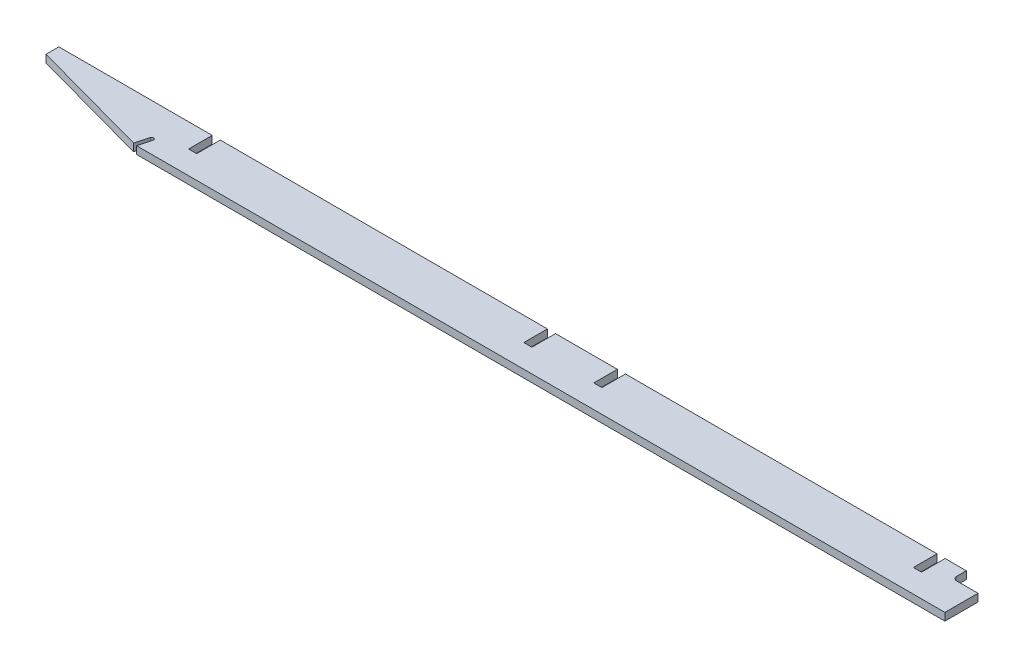
ISO-10303-21;
HEADER;
FILE_DESCRIPTION(('STEP AP214'),'2;1');
FILE_NAME('part.step','',(''),(''),'','','');
FILE_SCHEMA(('AUTOMOTIVE_DESIGN { 1 0 10303 214 1 1 1 1 }'));
ENDSEC;
DATA;
#1=APPLICATION_CONTEXT('core data for automotive mechanical design processes');
#2=APPLICATION_PROTOCOL_DEFINITION('international standard','automotive_design',2000,#1);
#3=PRODUCT_CONTEXT('',#1,'mechanical');
#4=PRODUCT('Part','Part','',(#3));
#5=PRODUCT_RELATED_PRODUCT_CATEGORY('part','',(#4));
#6=PRODUCT_DEFINITION_FORMATION('','',#4);
#7=PRODUCT_DEFINITION_CONTEXT('part definition',#1,'design');
#8=PRODUCT_DEFINITION('design','',#6,#7);
#9=PRODUCT_DEFINITION_SHAPE('','',#8);
#10=(LENGTH_UNIT() NAMED_UNIT(*) SI_UNIT(.MILLI.,.METRE.));
#11=(NAMED_UNIT(*) PLANE_ANGLE_UNIT() SI_UNIT($,.RADIAN.));
#12=(NAMED_UNIT(*) SI_UNIT($,.STERADIAN.) SOLID_ANGLE_UNIT());
#13=UNCERTAINTY_MEASURE_WITH_UNIT(LENGTH_MEASURE(1.E-05),#10,'distance_accuracy_value','');
#14=(GEOMETRIC_REPRESENTATION_CONTEXT(3) GLOBAL_UNCERTAINTY_ASSIGNED_CONTEXT((#13)) GLOBAL_UNIT_ASSIGNED_CONTEXT((#10,
#11,#12)) REPRESENTATION_CONTEXT('',''));
#15=CARTESIAN_POINT('',(0.,0.,0.));
#16=DIRECTION('',(0.,0.,1.));
#17=DIRECTION('',(1.,0.,0.));
#18=AXIS2_PLACEMENT_3D('',#15,#16,#17);
#19=CARTESIAN_POINT('',(-1457.76984888733,387.096,38.1));
#20=DIRECTION('',(-0.26471698178117,0.,0.964326147917118));
#21=DIRECTION('',(0.964326147917118,0.,0.26471698178117));
#22=AXIS2_PLACEMENT_3D('',#19,#20,#21);
#23=PLANE('',#22);
#24=DIRECTION('',(-0.964326147917118,0.,-0.26471698178117));
#25=VECTOR('',#24,1.);
#26=CARTESIAN_POINT('',(-1457.76984888733,374.65,38.1));
#27=LINE('',#26,#25);
#28=CARTESIAN_POINT('',(-1323.73398806948,374.65,74.8941578715673));
#29=VERTEX_POINT('',#28);
#30=CARTESIAN_POINT('',(-1520.36270603019,374.65,20.9176470588235));
#31=VERTEX_POINT('',#30);
#32=EDGE_CURVE('E370',#29,#31,#27,.T.);
#33=ORIENTED_EDGE('',*,*,#32,.F.);
#34=DIRECTION('',(0.,1.,0.));
#35=VECTOR('',#34,1.);
#36=CARTESIAN_POINT('',(-1323.73398806948,-2244.13415908109,74.8941578715673));
#37=LINE('',#36,#35);
#38=CARTESIAN_POINT('',(-1323.73398806948,387.096,74.8941578715673));
#39=VERTEX_POINT('',#38);
#40=EDGE_CURVE('E258',#29,#39,#37,.T.);
#41=ORIENTED_EDGE('',*,*,#40,.T.);
#42=DIRECTION('',(-0.964326147917118,0.,-0.26471698178117));
#43=VECTOR('',#42,1.);
#44=CARTESIAN_POINT('',(-1457.76984888733,387.096,38.1));
#45=LINE('',#44,#43);
#46=CARTESIAN_POINT('',(-1520.36270603019,387.096,20.9176470588235));
#47=VERTEX_POINT('',#46);
#48=EDGE_CURVE('E545',#39,#47,#45,.T.);
#49=ORIENTED_EDGE('',*,*,#48,.T.);
#50=DIRECTION('',(0.,-1.,0.));
#51=VECTOR('',#50,1.);
#52=CARTESIAN_POINT('',(-1520.36270603019,387.096,20.9176470588235));
#53=LINE('',#52,#51);
#54=EDGE_CURVE('E332',#47,#31,#53,.T.);
#55=ORIENTED_EDGE('',*,*,#54,.T.);
#56=EDGE_LOOP('',(#33,#41,#49,#55));
#57=FACE_BOUND('',#56,.T.);
#58=ADVANCED_FACE('F16',(#57),#23,.T.);
#59=CARTESIAN_POINT('',(-798.281353015096,387.096,44.45));
#60=DIRECTION('',(0.,-1.,0.));
#61=DIRECTION('',(1.,0.,0.));
#62=AXIS2_PLACEMENT_3D('',#59,#60,#61);
#63=PLANE('',#62);
#64=DIRECTION('',(0.26471698178117,0.,-0.964326147917118));
#65=VECTOR('',#64,1.);
#66=CARTESIAN_POINT('',(-1273.01779440205,387.096,-85.8698074395561));
#67=LINE('',#66,#65);
#68=CARTESIAN_POINT('',(-1317.50754546389,387.096,76.2));
#69=VERTEX_POINT('',#68);
#70=CARTESIAN_POINT('',(-1311.72718211012,387.096,55.1429620684198));
#71=VERTEX_POINT('',#70);
#72=EDGE_CURVE('E324',#69,#71,#67,.T.);
#73=ORIENTED_EDGE('',*,*,#72,.F.);
#74=DIRECTION('',(1.,0.,0.));
#75=VECTOR('',#74,1.);
#76=CARTESIAN_POINT('',(-660.4,387.096,76.2));
#77=LINE('',#76,#75);
#78=CARTESIAN_POINT('',(2.22044604925032E-13,387.096,76.2));
#79=VERTEX_POINT('',#78);
#80=EDGE_CURVE('E541',#69,#79,#77,.T.);
#81=ORIENTED_EDGE('',*,*,#80,.T.);
#82=DIRECTION('',(0.,0.,1.));
#83=VECTOR('',#82,1.);
#84=CARTESIAN_POINT('',(2.22044604925032E-13,387.096,44.45));
#85=LINE('',#84,#83);
#86=CARTESIAN_POINT('',(2.22044604925032E-13,387.096,22.225));
#87=VERTEX_POINT('',#86);
#88=EDGE_CURVE('E504',#87,#79,#85,.T.);
#89=ORIENTED_EDGE('',*,*,#88,.F.);
#90=DIRECTION('',(-1.,0.,0.));
#91=VECTOR('',#90,1.);
#92=CARTESIAN_POINT('',(-798.281353015096,387.096,22.225));
#93=LINE('',#92,#91);
#94=CARTESIAN_POINT('',(-34.925,387.096,22.225));
#95=VERTEX_POINT('',#94);
#96=EDGE_CURVE('E317',#87,#95,#93,.T.);
#97=ORIENTED_EDGE('',*,*,#96,.T.);
#98=CARTESIAN_POINT('',(-34.925,387.096,15.875));
#99=DIRECTION('',(0.,-1.,0.));
#100=DIRECTION('',(0.,0.,-1.));
#101=AXIS2_PLACEMENT_3D('',#98,#99,#100);
#102=CIRCLE('',#101,6.35);
#103=CARTESIAN_POINT('',(-41.275,387.096,15.875));
#104=VERTEX_POINT('',#103);
#105=EDGE_CURVE('E25',#95,#104,#102,.T.);
#106=ORIENTED_EDGE('',*,*,#105,.T.);
#107=DIRECTION('',(0.,0.,-1.));
#108=VECTOR('',#107,1.);
#109=CARTESIAN_POINT('',(-41.275,387.096,44.45));
#110=LINE('',#109,#108);
#111=CARTESIAN_POINT('',(-41.275,387.096,0.));
#112=VERTEX_POINT('',#111);
#113=EDGE_CURVE('E314',#104,#112,#110,.T.);
#114=ORIENTED_EDGE('',*,*,#113,.T.);
#115=DIRECTION('',(1.,0.,0.));
#116=VECTOR('',#115,1.);
#117=CARTESIAN_POINT('',(-931.631353015096,387.096,0.));
#118=LINE('',#117,#116);
#119=CARTESIAN_POINT('',(-75.803125,387.096,0.));
#120=VERTEX_POINT('',#119);
#121=EDGE_CURVE('E365',#120,#112,#118,.T.);
#122=ORIENTED_EDGE('',*,*,#121,.F.);
#123=DIRECTION('',(0.,0.,-1.));
#124=VECTOR('',#123,1.);
#125=CARTESIAN_POINT('',(-75.803125,387.096,38.1));
#126=LINE('',#125,#124);
#127=CARTESIAN_POINT('',(-75.803125,387.096,38.496875));
#128=VERTEX_POINT('',#127);
#129=EDGE_CURVE('E316',#128,#120,#126,.T.);
#130=ORIENTED_EDGE('',*,*,#129,.F.);
#131=DIRECTION('',(-1.,0.,0.));
#132=VECTOR('',#131,1.);
#133=CARTESIAN_POINT('',(-59.5983301642671,387.096,38.496875));
#134=LINE('',#133,#132);
#135=CARTESIAN_POINT('',(-89.0428750000001,387.096,38.496875));
#136=VERTEX_POINT('',#135);
#137=EDGE_CURVE('E339',#128,#136,#134,.T.);
#138=ORIENTED_EDGE('',*,*,#137,.T.);
#139=DIRECTION('',(0.,0.,1.));
#140=VECTOR('',#139,1.);
#141=CARTESIAN_POINT('',(-89.0428750000001,387.096,38.1));
#142=LINE('',#141,#140);
#143=CARTESIAN_POINT('',(-89.0428750000001,387.096,0.));
#144=VERTEX_POINT('',#143);
#145=EDGE_CURVE('E353',#144,#136,#142,.T.);
#146=ORIENTED_EDGE('',*,*,#145,.F.);
#147=CARTESIAN_POINT('',(-596.773,387.096,0.));
#148=VERTEX_POINT('',#147);
#149=EDGE_CURVE('E369',#148,#144,#118,.T.);
#150=ORIENTED_EDGE('',*,*,#149,.F.);
#151=DIRECTION('',(0.,0.,1.));
#152=VECTOR('',#151,1.);
#153=CARTESIAN_POINT('',(-596.773,387.096,44.45));
#154=LINE('',#153,#152);
#155=CARTESIAN_POINT('',(-596.773,387.096,38.481));
#156=VERTEX_POINT('',#155);
#157=EDGE_CURVE('E1074',#148,#156,#154,.T.);
#158=ORIENTED_EDGE('',*,*,#157,.T.);
#159=DIRECTION('',(-1.,0.,0.));
#160=VECTOR('',#159,1.);
#161=CARTESIAN_POINT('',(-798.281353015096,387.096,38.481));
#162=LINE('',#161,#160);
#163=CARTESIAN_POINT('',(-609.981,387.096,38.481));
#164=VERTEX_POINT('',#163);
#165=EDGE_CURVE('E392',#156,#164,#162,.T.);
#166=ORIENTED_EDGE('',*,*,#165,.T.);
#167=DIRECTION('',(0.,0.,-1.));
#168=VECTOR('',#167,1.);
#169=CARTESIAN_POINT('',(-609.981,387.096,44.45));
#170=LINE('',#169,#168);
#171=CARTESIAN_POINT('',(-609.981,387.096,0.));
#172=VERTEX_POINT('',#171);
#173=EDGE_CURVE('E1049',#164,#172,#170,.T.);
#174=ORIENTED_EDGE('',*,*,#173,.T.);
#175=CARTESIAN_POINT('',(-710.819,387.096,0.));
#176=VERTEX_POINT('',#175);
#177=EDGE_CURVE('E428',#176,#172,#118,.T.);
#178=ORIENTED_EDGE('',*,*,#177,.F.);
#179=DIRECTION('',(0.,0.,1.));
#180=VECTOR('',#179,1.);
#181=CARTESIAN_POINT('',(-710.819,387.096,44.45));
#182=LINE('',#181,#180);
#183=CARTESIAN_POINT('',(-710.819,387.096,38.481));
#184=VERTEX_POINT('',#183);
#185=EDGE_CURVE('E1168',#176,#184,#182,.T.);
#186=ORIENTED_EDGE('',*,*,#185,.T.);
#187=DIRECTION('',(-1.,0.,0.));
#188=VECTOR('',#187,1.);
#189=CARTESIAN_POINT('',(-798.281353015096,387.096,38.481));
#190=LINE('',#189,#188);
#191=CARTESIAN_POINT('',(-724.027,387.096,38.481));
#192=VERTEX_POINT('',#191);
#193=EDGE_CURVE('E1161',#184,#192,#190,.T.);
#194=ORIENTED_EDGE('',*,*,#193,.T.);
#195=DIRECTION('',(0.,0.,-1.));
#196=VECTOR('',#195,1.);
#197=CARTESIAN_POINT('',(-724.027,387.096,44.45));
#198=LINE('',#197,#196);
#199=CARTESIAN_POINT('',(-724.027,387.096,0.));
#200=VERTEX_POINT('',#199);
#201=EDGE_CURVE('E1050',#192,#200,#198,.T.);
#202=ORIENTED_EDGE('',*,*,#201,.T.);
#203=CARTESIAN_POINT('',(-1257.173,387.096,0.));
#204=VERTEX_POINT('',#203);
#205=EDGE_CURVE('E424',#204,#200,#118,.T.);
#206=ORIENTED_EDGE('',*,*,#205,.F.);
#207=DIRECTION('',(0.,0.,1.));
#208=VECTOR('',#207,1.);
#209=CARTESIAN_POINT('',(-1257.173,387.096,44.45));
#210=LINE('',#209,#208);
#211=CARTESIAN_POINT('',(-1257.173,387.096,38.481));
#212=VERTEX_POINT('',#211);
#213=EDGE_CURVE('E456',#204,#212,#210,.T.);
#214=ORIENTED_EDGE('',*,*,#213,.T.);
#215=DIRECTION('',(-1.,0.,0.));
#216=VECTOR('',#215,1.);
#217=CARTESIAN_POINT('',(-798.281353015096,387.096,38.481));
#218=LINE('',#217,#216);
#219=CARTESIAN_POINT('',(-1270.381,387.096,38.481));
#220=VERTEX_POINT('',#219);
#221=EDGE_CURVE('E451',#212,#220,#218,.T.);
#222=ORIENTED_EDGE('',*,*,#221,.T.);
#223=DIRECTION('',(0.,0.,-1.));
#224=VECTOR('',#223,1.);
#225=CARTESIAN_POINT('',(-1270.381,387.096,44.45));
#226=LINE('',#225,#224);
#227=CARTESIAN_POINT('',(-1270.381,387.096,0.));
#228=VERTEX_POINT('',#227);
#229=EDGE_CURVE('E480',#220,#228,#226,.T.);
#230=ORIENTED_EDGE('',*,*,#229,.T.);
#231=CARTESIAN_POINT('',(-1520.36270603019,387.096,0.));
#232=VERTEX_POINT('',#231);
#233=EDGE_CURVE('E372',#232,#228,#118,.T.);
#234=ORIENTED_EDGE('',*,*,#233,.F.);
#235=DIRECTION('',(0.,0.,-1.));
#236=VECTOR('',#235,1.);
#237=CARTESIAN_POINT('',(-1520.36270603019,387.096,20.9176470588235));
#238=LINE('',#237,#236);
#239=EDGE_CURVE('E264',#232,#47,#238,.F.);
#240=ORIENTED_EDGE('',*,*,#239,.T.);
#241=ORIENTED_EDGE('',*,*,#48,.F.);
#242=DIRECTION('',(0.26471698178117,0.,-0.964326147917118));
#243=VECTOR('',#242,1.);
#244=CARTESIAN_POINT('',(-1279.14126544132,387.096,-87.5507602738665));
#245=LINE('',#244,#243);
#246=CARTESIAN_POINT('',(-1317.8506531494,387.096,53.4620092341093));
#247=VERTEX_POINT('',#246);
#248=EDGE_CURVE('E599',#39,#247,#245,.T.);
#249=ORIENTED_EDGE('',*,*,#248,.T.);
#250=CARTESIAN_POINT('',(-1314.78891762976,387.096,54.3024856512645));
#251=DIRECTION('',(0.,-1.,0.));
#252=DIRECTION('',(0.,0.,-1.));
#253=AXIS2_PLACEMENT_3D('',#250,#251,#252);
#254=CIRCLE('',#253,3.175);
#255=EDGE_CURVE('E271',#247,#71,#254,.T.);
#256=ORIENTED_EDGE('',*,*,#255,.T.);
#257=EDGE_LOOP('',(#73,#81,#89,#97,#106,#114,#122,#130,#138,#146,#150,#158,#166,#174,#178,#186,
#194,#202,#206,#214,#222,#230,#234,#240,#241,#249,#256));
#258=FACE_BOUND('',#257,.T.);
#259=ADVANCED_FACE('F561',(#258),#63,.F.);
#260=CARTESIAN_POINT('',(-660.4,387.096,76.2));
#261=DIRECTION('',(0.,0.,-1.));
#262=DIRECTION('',(-1.,0.,0.));
#263=AXIS2_PLACEMENT_3D('',#260,#261,#262);
#264=PLANE('',#263);
#265=DIRECTION('',(0.,1.,0.));
#266=VECTOR('',#265,1.);
#267=CARTESIAN_POINT('',(-1317.50754546389,387.096,76.2));
#268=LINE('',#267,#266);
#269=CARTESIAN_POINT('',(-1317.50754546389,374.65,76.2));
#270=VERTEX_POINT('',#269);
#271=EDGE_CURVE('E584',#270,#69,#268,.T.);
#272=ORIENTED_EDGE('',*,*,#271,.F.);
#273=DIRECTION('',(1.,0.,0.));
#274=VECTOR('',#273,1.);
#275=CARTESIAN_POINT('',(-660.4,374.65,76.2));
#276=LINE('',#275,#274);
#277=CARTESIAN_POINT('',(2.22044604925032E-13,374.65,76.2));
#278=VERTEX_POINT('',#277);
#279=EDGE_CURVE('E412',#270,#278,#276,.T.);
#280=ORIENTED_EDGE('',*,*,#279,.T.);
#281=DIRECTION('',(0.,-1.,0.));
#282=VECTOR('',#281,1.);
#283=CARTESIAN_POINT('',(2.22044604925032E-13,387.096,76.2));
#284=LINE('',#283,#282);
#285=EDGE_CURVE('E441',#79,#278,#284,.T.);
#286=ORIENTED_EDGE('',*,*,#285,.F.);
#287=ORIENTED_EDGE('',*,*,#80,.F.);
#288=EDGE_LOOP('',(#272,#280,#286,#287));
#289=FACE_BOUND('',#288,.T.);
#290=ADVANCED_FACE('F556',(#289),#264,.F.);
#291=CARTESIAN_POINT('',(-798.281353015096,374.65,44.45));
#292=DIRECTION('',(0.,-1.,0.));
#293=DIRECTION('',(1.,0.,0.));
#294=AXIS2_PLACEMENT_3D('',#291,#292,#293);
#295=PLANE('',#294);
#296=ORIENTED_EDGE('',*,*,#279,.F.);
#297=DIRECTION('',(0.26471698178117,0.,-0.964326147917118));
#298=VECTOR('',#297,1.);
#299=CARTESIAN_POINT('',(-1273.01779440205,374.65,-85.8698074395561));
#300=LINE('',#299,#298);
#301=CARTESIAN_POINT('',(-1311.72718211012,374.65,55.1429620684198));
#302=VERTEX_POINT('',#301);
#303=EDGE_CURVE('E278',#270,#302,#300,.T.);
#304=ORIENTED_EDGE('',*,*,#303,.T.);
#305=CARTESIAN_POINT('',(-1314.78891762976,374.65,54.3024856512645));
#306=DIRECTION('',(0.,-1.,0.));
#307=DIRECTION('',(0.,0.,-1.));
#308=AXIS2_PLACEMENT_3D('',#305,#306,#307);
#309=CIRCLE('',#308,3.175);
#310=CARTESIAN_POINT('',(-1317.8506531494,374.65,53.4620092341093));
#311=VERTEX_POINT('',#310);
#312=EDGE_CURVE('E263',#311,#302,#309,.T.);
#313=ORIENTED_EDGE('',*,*,#312,.F.);
#314=DIRECTION('',(0.26471698178117,0.,-0.964326147917118));
#315=VECTOR('',#314,1.);
#316=CARTESIAN_POINT('',(-1279.14126544132,374.65,-87.5507602738665));
#317=LINE('',#316,#315);
#318=EDGE_CURVE('E252',#29,#311,#317,.T.);
#319=ORIENTED_EDGE('',*,*,#318,.F.);
#320=ORIENTED_EDGE('',*,*,#32,.T.);
#321=DIRECTION('',(0.,0.,1.));
#322=VECTOR('',#321,1.);
#323=CARTESIAN_POINT('',(-1520.36270603019,374.65,44.4500000000076));
#324=LINE('',#323,#322);
#325=CARTESIAN_POINT('',(-1520.36270603019,374.65,0.));
#326=VERTEX_POINT('',#325);
#327=EDGE_CURVE('E1132',#31,#326,#324,.F.);
#328=ORIENTED_EDGE('',*,*,#327,.T.);
#329=DIRECTION('',(1.,0.,0.));
#330=VECTOR('',#329,1.);
#331=CARTESIAN_POINT('',(-931.631353015096,374.65,0.));
#332=LINE('',#331,#330);
#333=CARTESIAN_POINT('',(-1270.381,374.65,-1.45716771982052E-13));
#334=VERTEX_POINT('',#333);
#335=EDGE_CURVE('E394',#326,#334,#332,.T.);
#336=ORIENTED_EDGE('',*,*,#335,.T.);
#337=DIRECTION('',(0.,0.,-1.));
#338=VECTOR('',#337,1.);
#339=CARTESIAN_POINT('',(-1270.381,374.65,44.45));
#340=LINE('',#339,#338);
#341=CARTESIAN_POINT('',(-1270.381,374.65,38.481));
#342=VERTEX_POINT('',#341);
#343=EDGE_CURVE('E434',#342,#334,#340,.T.);
#344=ORIENTED_EDGE('',*,*,#343,.F.);
#345=DIRECTION('',(-1.,0.,0.));
#346=VECTOR('',#345,1.);
#347=CARTESIAN_POINT('',(-798.281353015096,374.65,38.481));
#348=LINE('',#347,#346);
#349=CARTESIAN_POINT('',(-1257.173,374.65,38.481));
#350=VERTEX_POINT('',#349);
#351=EDGE_CURVE('E431',#350,#342,#348,.T.);
#352=ORIENTED_EDGE('',*,*,#351,.F.);
#353=DIRECTION('',(0.,0.,1.));
#354=VECTOR('',#353,1.);
#355=CARTESIAN_POINT('',(-1257.173,374.65,44.45));
#356=LINE('',#355,#354);
#357=CARTESIAN_POINT('',(-1257.173,374.65,0.));
#358=VERTEX_POINT('',#357);
#359=EDGE_CURVE('E435',#358,#350,#356,.T.);
#360=ORIENTED_EDGE('',*,*,#359,.F.);
#361=CARTESIAN_POINT('',(-724.027,374.65,-1.45716771982052E-13));
#362=VERTEX_POINT('',#361);
#363=EDGE_CURVE('E416',#358,#362,#332,.T.);
#364=ORIENTED_EDGE('',*,*,#363,.T.);
#365=DIRECTION('',(0.,0.,-1.));
#366=VECTOR('',#365,1.);
#367=CARTESIAN_POINT('',(-724.027,374.65,44.45));
#368=LINE('',#367,#366);
#369=CARTESIAN_POINT('',(-724.027,374.65,38.481));
#370=VERTEX_POINT('',#369);
#371=EDGE_CURVE('E1067',#370,#362,#368,.T.);
#372=ORIENTED_EDGE('',*,*,#371,.F.);
#373=DIRECTION('',(-1.,0.,0.));
#374=VECTOR('',#373,1.);
#375=CARTESIAN_POINT('',(-798.281353015096,374.65,38.481));
#376=LINE('',#375,#374);
#377=CARTESIAN_POINT('',(-710.819,374.65,38.481));
#378=VERTEX_POINT('',#377);
#379=EDGE_CURVE('E1122',#378,#370,#376,.T.);
#380=ORIENTED_EDGE('',*,*,#379,.F.);
#381=DIRECTION('',(0.,0.,1.));
#382=VECTOR('',#381,1.);
#383=CARTESIAN_POINT('',(-710.819,374.65,44.45));
#384=LINE('',#383,#382);
#385=CARTESIAN_POINT('',(-710.819,374.65,0.));
#386=VERTEX_POINT('',#385);
#387=EDGE_CURVE('E447',#386,#378,#384,.T.);
#388=ORIENTED_EDGE('',*,*,#387,.F.);
#389=CARTESIAN_POINT('',(-609.981,374.65,-1.45716771982052E-13));
#390=VERTEX_POINT('',#389);
#391=EDGE_CURVE('E420',#386,#390,#332,.T.);
#392=ORIENTED_EDGE('',*,*,#391,.T.);
#393=DIRECTION('',(0.,0.,-1.));
#394=VECTOR('',#393,1.);
#395=CARTESIAN_POINT('',(-609.981,374.65,44.45));
#396=LINE('',#395,#394);
#397=CARTESIAN_POINT('',(-609.981,374.65,38.481));
#398=VERTEX_POINT('',#397);
#399=EDGE_CURVE('E1063',#398,#390,#396,.T.);
#400=ORIENTED_EDGE('',*,*,#399,.F.);
#401=DIRECTION('',(-1.,0.,0.));
#402=VECTOR('',#401,1.);
#403=CARTESIAN_POINT('',(-798.281353015096,374.65,38.481));
#404=LINE('',#403,#402);
#405=CARTESIAN_POINT('',(-596.773,374.65,38.481));
#406=VERTEX_POINT('',#405);
#407=EDGE_CURVE('E1066',#406,#398,#404,.T.);
#408=ORIENTED_EDGE('',*,*,#407,.F.);
#409=DIRECTION('',(0.,0.,1.));
#410=VECTOR('',#409,1.);
#411=CARTESIAN_POINT('',(-596.773,374.65,44.45));
#412=LINE('',#411,#410);
#413=CARTESIAN_POINT('',(-596.773,374.65,-1.45716771982052E-13));
#414=VERTEX_POINT('',#413);
#415=EDGE_CURVE('E383',#414,#406,#412,.T.);
#416=ORIENTED_EDGE('',*,*,#415,.F.);
#417=CARTESIAN_POINT('',(-89.0428750000001,374.65,-1.45716771982052E-13));
#418=VERTEX_POINT('',#417);
#419=EDGE_CURVE('E391',#414,#418,#332,.T.);
#420=ORIENTED_EDGE('',*,*,#419,.T.);
#421=DIRECTION('',(0.,0.,-1.));
#422=VECTOR('',#421,1.);
#423=CARTESIAN_POINT('',(-89.0428750000001,374.65,44.45));
#424=LINE('',#423,#422);
#425=CARTESIAN_POINT('',(-89.0428750000001,374.65,38.496875));
#426=VERTEX_POINT('',#425);
#427=EDGE_CURVE('E309',#426,#418,#424,.T.);
#428=ORIENTED_EDGE('',*,*,#427,.F.);
#429=DIRECTION('',(1.,0.,0.));
#430=VECTOR('',#429,1.);
#431=CARTESIAN_POINT('',(-798.281353015096,374.65,38.4968750000003));
#432=LINE('',#431,#430);
#433=CARTESIAN_POINT('',(-75.803125,374.65,38.496875));
#434=VERTEX_POINT('',#433);
#435=EDGE_CURVE('E382',#426,#434,#432,.T.);
#436=ORIENTED_EDGE('',*,*,#435,.T.);
#437=DIRECTION('',(0.,0.,1.));
#438=VECTOR('',#437,1.);
#439=CARTESIAN_POINT('',(-75.803125,374.65,44.45));
#440=LINE('',#439,#438);
#441=CARTESIAN_POINT('',(-75.803125,374.65,0.));
#442=VERTEX_POINT('',#441);
#443=EDGE_CURVE('E379',#442,#434,#440,.T.);
#444=ORIENTED_EDGE('',*,*,#443,.F.);
#445=CARTESIAN_POINT('',(-41.275,374.65,0.));
#446=VERTEX_POINT('',#445);
#447=EDGE_CURVE('E388',#442,#446,#332,.T.);
#448=ORIENTED_EDGE('',*,*,#447,.T.);
#449=DIRECTION('',(0.,0.,-1.));
#450=VECTOR('',#449,1.);
#451=CARTESIAN_POINT('',(-41.275,374.65,44.45));
#452=LINE('',#451,#450);
#453=CARTESIAN_POINT('',(-41.275,374.65,15.875));
#454=VERTEX_POINT('',#453);
#455=EDGE_CURVE('E308',#454,#446,#452,.T.);
#456=ORIENTED_EDGE('',*,*,#455,.F.);
#457=CARTESIAN_POINT('',(-34.925,374.65,15.875));
#458=DIRECTION('',(0.,-1.,0.));
#459=DIRECTION('',(0.,0.,-1.));
#460=AXIS2_PLACEMENT_3D('',#457,#458,#459);
#461=CIRCLE('',#460,6.35);
#462=CARTESIAN_POINT('',(-34.925,374.65,22.225));
#463=VERTEX_POINT('',#462);
#464=EDGE_CURVE('E11',#454,#463,#461,.F.);
#465=ORIENTED_EDGE('',*,*,#464,.T.);
#466=DIRECTION('',(-1.,0.,0.));
#467=VECTOR('',#466,1.);
#468=CARTESIAN_POINT('',(-798.281353015096,374.65,22.225));
#469=LINE('',#468,#467);
#470=CARTESIAN_POINT('',(2.22044604925032E-13,374.65,22.225));
#471=VERTEX_POINT('',#470);
#472=EDGE_CURVE('E304',#471,#463,#469,.T.);
#473=ORIENTED_EDGE('',*,*,#472,.F.);
#474=DIRECTION('',(0.,0.,1.));
#475=VECTOR('',#474,1.);
#476=CARTESIAN_POINT('',(2.22044604925032E-13,374.65,44.45));
#477=LINE('',#476,#475);
#478=EDGE_CURVE('E408',#471,#278,#477,.T.);
#479=ORIENTED_EDGE('',*,*,#478,.T.);
#480=EDGE_LOOP('',(#296,#304,#313,#319,#320,#328,#336,#344,#352,#360,#364,#372,#380,#388,#392,
#400,#408,#416,#420,#428,#436,#444,#448,#456,#465,#473,#479));
#481=FACE_BOUND('',#480,.T.);
#482=ADVANCED_FACE('F277',(#481),#295,.T.);
#483=CARTESIAN_POINT('',(-931.631353015096,387.096,0.));
#484=DIRECTION('',(0.,0.,-1.));
#485=DIRECTION('',(-1.,0.,0.));
#486=AXIS2_PLACEMENT_3D('',#483,#484,#485);
#487=PLANE('',#486);
#488=DIRECTION('',(0.,1.,0.));
#489=VECTOR('',#488,1.);
#490=CARTESIAN_POINT('',(-89.0428750000001,387.096,0.));
#491=LINE('',#490,#489);
#492=EDGE_CURVE('E360',#418,#144,#491,.T.);
#493=ORIENTED_EDGE('',*,*,#492,.F.);
#494=ORIENTED_EDGE('',*,*,#419,.F.);
#495=DIRECTION('',(0.,-1.,0.));
#496=VECTOR('',#495,1.);
#497=CARTESIAN_POINT('',(-596.773,387.096,0.));
#498=LINE('',#497,#496);
#499=EDGE_CURVE('E1072',#148,#414,#498,.T.);
#500=ORIENTED_EDGE('',*,*,#499,.F.);
#501=ORIENTED_EDGE('',*,*,#149,.T.);
#502=EDGE_LOOP('',(#493,#494,#500,#501));
#503=FACE_BOUND('',#502,.T.);
#504=ADVANCED_FACE('F685',(#503),#487,.T.);
#505=DIRECTION('',(0.,1.,0.));
#506=VECTOR('',#505,1.);
#507=CARTESIAN_POINT('',(-41.275,-2295.26058781173,0.));
#508=LINE('',#507,#506);
#509=EDGE_CURVE('E320',#446,#112,#508,.T.);
#510=ORIENTED_EDGE('',*,*,#509,.F.);
#511=ORIENTED_EDGE('',*,*,#447,.F.);
#512=DIRECTION('',(0.,-1.,0.));
#513=VECTOR('',#512,1.);
#514=CARTESIAN_POINT('',(-75.8031250000001,387.096,0.));
#515=LINE('',#514,#513);
#516=EDGE_CURVE('E346',#120,#442,#515,.T.);
#517=ORIENTED_EDGE('',*,*,#516,.F.);
#518=ORIENTED_EDGE('',*,*,#121,.T.);
#519=EDGE_LOOP('',(#510,#511,#517,#518));
#520=FACE_BOUND('',#519,.T.);
#521=ADVANCED_FACE('F721',(#520),#487,.T.);
#522=DIRECTION('',(0.,1.,0.));
#523=VECTOR('',#522,1.);
#524=CARTESIAN_POINT('',(-724.027,387.096,0.));
#525=LINE('',#524,#523);
#526=EDGE_CURVE('E1158',#362,#200,#525,.T.);
#527=ORIENTED_EDGE('',*,*,#526,.F.);
#528=ORIENTED_EDGE('',*,*,#363,.F.);
#529=DIRECTION('',(0.,-1.,0.));
#530=VECTOR('',#529,1.);
#531=CARTESIAN_POINT('',(-1257.173,387.096,0.));
#532=LINE('',#531,#530);
#533=EDGE_CURVE('E463',#204,#358,#532,.T.);
#534=ORIENTED_EDGE('',*,*,#533,.F.);
#535=ORIENTED_EDGE('',*,*,#205,.T.);
#536=EDGE_LOOP('',(#527,#528,#534,#535));
#537=FACE_BOUND('',#536,.T.);
#538=ADVANCED_FACE('F528',(#537),#487,.T.);
#539=ORIENTED_EDGE('',*,*,#335,.F.);
#540=DIRECTION('',(0.,1.,0.));
#541=VECTOR('',#540,1.);
#542=CARTESIAN_POINT('',(-1520.36270603019,387.096,0.));
#543=LINE('',#542,#541);
#544=EDGE_CURVE('E1135',#326,#232,#543,.T.);
#545=ORIENTED_EDGE('',*,*,#544,.T.);
#546=ORIENTED_EDGE('',*,*,#233,.T.);
#547=DIRECTION('',(0.,1.,0.));
#548=VECTOR('',#547,1.);
#549=CARTESIAN_POINT('',(-1270.381,387.096,0.));
#550=LINE('',#549,#548);
#551=EDGE_CURVE('E455',#334,#228,#550,.T.);
#552=ORIENTED_EDGE('',*,*,#551,.F.);
#553=EDGE_LOOP('',(#539,#545,#546,#552));
#554=FACE_BOUND('',#553,.T.);
#555=ADVANCED_FACE('F522',(#554),#487,.T.);
#556=DIRECTION('',(0.,1.,0.));
#557=VECTOR('',#556,1.);
#558=CARTESIAN_POINT('',(-609.981,387.096,0.));
#559=LINE('',#558,#557);
#560=EDGE_CURVE('E1046',#390,#172,#559,.T.);
#561=ORIENTED_EDGE('',*,*,#560,.F.);
#562=ORIENTED_EDGE('',*,*,#391,.F.);
#563=DIRECTION('',(0.,-1.,0.));
#564=VECTOR('',#563,1.);
#565=CARTESIAN_POINT('',(-710.819,387.096,0.));
#566=LINE('',#565,#564);
#567=EDGE_CURVE('E483',#176,#386,#566,.T.);
#568=ORIENTED_EDGE('',*,*,#567,.F.);
#569=ORIENTED_EDGE('',*,*,#177,.T.);
#570=EDGE_LOOP('',(#561,#562,#568,#569));
#571=FACE_BOUND('',#570,.T.);
#572=ADVANCED_FACE('F527',(#571),#487,.T.);
#573=CARTESIAN_POINT('',(2.22044604925032E-13,387.096,38.1));
#574=DIRECTION('',(1.,0.,0.));
#575=DIRECTION('',(0.,0.,-1.));
#576=AXIS2_PLACEMENT_3D('',#573,#574,#575);
#577=PLANE('',#576);
#578=DIRECTION('',(0.,-1.,0.));
#579=VECTOR('',#578,1.);
#580=CARTESIAN_POINT('',(2.22044604925032E-13,387.096,22.225));
#581=LINE('',#580,#579);
#582=EDGE_CURVE('E323',#87,#471,#581,.T.);
#583=ORIENTED_EDGE('',*,*,#582,.F.);
#584=ORIENTED_EDGE('',*,*,#88,.T.);
#585=ORIENTED_EDGE('',*,*,#285,.T.);
#586=ORIENTED_EDGE('',*,*,#478,.F.);
#587=EDGE_LOOP('',(#583,#584,#585,#586));
#588=FACE_BOUND('',#587,.T.);
#589=ADVANCED_FACE('F753',(#588),#577,.T.);
#590=CARTESIAN_POINT('',(-1270.381,-2244.46058781173,38.1));
#591=DIRECTION('',(-1.,0.,0.));
#592=DIRECTION('',(0.,0.,1.));
#593=AXIS2_PLACEMENT_3D('',#590,#591,#592);
#594=PLANE('',#593);
#595=DIRECTION('',(0.,1.,0.));
#596=VECTOR('',#595,1.);
#597=CARTESIAN_POINT('',(-1270.381,-2244.46058781173,38.481));
#598=LINE('',#597,#596);
#599=EDGE_CURVE('E470',#342,#220,#598,.T.);
#600=ORIENTED_EDGE('',*,*,#599,.F.);
#601=ORIENTED_EDGE('',*,*,#343,.T.);
#602=ORIENTED_EDGE('',*,*,#551,.T.);
#603=ORIENTED_EDGE('',*,*,#229,.F.);
#604=EDGE_LOOP('',(#600,#601,#602,#603));
#605=FACE_BOUND('',#604,.T.);
#606=ADVANCED_FACE('F763',(#605),#594,.F.);
#607=CARTESIAN_POINT('',(-936.879,-2244.46058781173,38.481));
#608=DIRECTION('',(0.,0.,1.));
#609=DIRECTION('',(1.,0.,0.));
#610=AXIS2_PLACEMENT_3D('',#607,#608,#609);
#611=PLANE('',#610);
#612=DIRECTION('',(0.,1.,0.));
#613=VECTOR('',#612,1.);
#614=CARTESIAN_POINT('',(-1257.173,-2244.46058781173,38.481));
#615=LINE('',#614,#613);
#616=EDGE_CURVE('E398',#350,#212,#615,.T.);
#617=ORIENTED_EDGE('',*,*,#616,.F.);
#618=ORIENTED_EDGE('',*,*,#351,.T.);
#619=ORIENTED_EDGE('',*,*,#599,.T.);
#620=ORIENTED_EDGE('',*,*,#221,.F.);
#621=EDGE_LOOP('',(#617,#618,#619,#620));
#622=FACE_BOUND('',#621,.T.);
#623=ADVANCED_FACE('F774',(#622),#611,.F.);
#624=CARTESIAN_POINT('',(-1257.173,-2244.46058781173,38.1));
#625=DIRECTION('',(1.,0.,0.));
#626=DIRECTION('',(0.,0.,-1.));
#627=AXIS2_PLACEMENT_3D('',#624,#625,#626);
#628=PLANE('',#627);
#629=ORIENTED_EDGE('',*,*,#533,.T.);
#630=ORIENTED_EDGE('',*,*,#359,.T.);
#631=ORIENTED_EDGE('',*,*,#616,.T.);
#632=ORIENTED_EDGE('',*,*,#213,.F.);
#633=EDGE_LOOP('',(#629,#630,#631,#632));
#634=FACE_BOUND('',#633,.T.);
#635=ADVANCED_FACE('F786',(#634),#628,.F.);
#636=CARTESIAN_POINT('',(-724.027,-2244.46058781173,38.1));
#637=DIRECTION('',(-1.,0.,0.));
#638=DIRECTION('',(0.,0.,1.));
#639=AXIS2_PLACEMENT_3D('',#636,#637,#638);
#640=PLANE('',#639);
#641=DIRECTION('',(0.,1.,0.));
#642=VECTOR('',#641,1.);
#643=CARTESIAN_POINT('',(-724.027,-2244.46058781173,38.481));
#644=LINE('',#643,#642);
#645=EDGE_CURVE('E1058',#370,#192,#644,.T.);
#646=ORIENTED_EDGE('',*,*,#645,.F.);
#647=ORIENTED_EDGE('',*,*,#371,.T.);
#648=ORIENTED_EDGE('',*,*,#526,.T.);
#649=ORIENTED_EDGE('',*,*,#201,.F.);
#650=EDGE_LOOP('',(#646,#647,#648,#649));
#651=FACE_BOUND('',#650,.T.);
#652=ADVANCED_FACE('F798',(#651),#640,.F.);
#653=CARTESIAN_POINT('',(-936.879,-2244.46058781173,38.481));
#654=DIRECTION('',(0.,0.,1.));
#655=DIRECTION('',(1.,0.,0.));
#656=AXIS2_PLACEMENT_3D('',#653,#654,#655);
#657=PLANE('',#656);
#658=DIRECTION('',(0.,1.,0.));
#659=VECTOR('',#658,1.);
#660=CARTESIAN_POINT('',(-710.819,-2244.46058781173,38.481));
#661=LINE('',#660,#659);
#662=EDGE_CURVE('E489',#378,#184,#661,.T.);
#663=ORIENTED_EDGE('',*,*,#662,.F.);
#664=ORIENTED_EDGE('',*,*,#379,.T.);
#665=ORIENTED_EDGE('',*,*,#645,.T.);
#666=ORIENTED_EDGE('',*,*,#193,.F.);
#667=EDGE_LOOP('',(#663,#664,#665,#666));
#668=FACE_BOUND('',#667,.T.);
#669=ADVANCED_FACE('F810',(#668),#657,.F.);
#670=CARTESIAN_POINT('',(-710.819,-2244.46058781173,38.1));
#671=DIRECTION('',(1.,0.,0.));
#672=DIRECTION('',(0.,0.,-1.));
#673=AXIS2_PLACEMENT_3D('',#670,#671,#672);
#674=PLANE('',#673);
#675=ORIENTED_EDGE('',*,*,#567,.T.);
#676=ORIENTED_EDGE('',*,*,#387,.T.);
#677=ORIENTED_EDGE('',*,*,#662,.T.);
#678=ORIENTED_EDGE('',*,*,#185,.F.);
#679=EDGE_LOOP('',(#675,#676,#677,#678));
#680=FACE_BOUND('',#679,.T.);
#681=ADVANCED_FACE('F822',(#680),#674,.F.);
#682=CARTESIAN_POINT('',(-936.879,-2244.46058781173,38.481));
#683=DIRECTION('',(0.,0.,1.));
#684=DIRECTION('',(1.,0.,0.));
#685=AXIS2_PLACEMENT_3D('',#682,#683,#684);
#686=PLANE('',#685);
#687=DIRECTION('',(0.,1.,0.));
#688=VECTOR('',#687,1.);
#689=CARTESIAN_POINT('',(-596.773,-2244.46058781173,38.481));
#690=LINE('',#689,#688);
#691=EDGE_CURVE('E495',#406,#156,#690,.T.);
#692=ORIENTED_EDGE('',*,*,#691,.F.);
#693=ORIENTED_EDGE('',*,*,#407,.T.);
#694=DIRECTION('',(0.,1.,0.));
#695=VECTOR('',#694,1.);
#696=CARTESIAN_POINT('',(-609.981,-2244.46058781173,38.481));
#697=LINE('',#696,#695);
#698=EDGE_CURVE('E1054',#398,#164,#697,.T.);
#699=ORIENTED_EDGE('',*,*,#698,.T.);
#700=ORIENTED_EDGE('',*,*,#165,.F.);
#701=EDGE_LOOP('',(#692,#693,#699,#700));
#702=FACE_BOUND('',#701,.T.);
#703=ADVANCED_FACE('F834',(#702),#686,.F.);
#704=CARTESIAN_POINT('',(-596.773,-2244.46058781173,38.1));
#705=DIRECTION('',(1.,0.,0.));
#706=DIRECTION('',(0.,0.,-1.));
#707=AXIS2_PLACEMENT_3D('',#704,#705,#706);
#708=PLANE('',#707);
#709=ORIENTED_EDGE('',*,*,#499,.T.);
#710=ORIENTED_EDGE('',*,*,#415,.T.);
#711=ORIENTED_EDGE('',*,*,#691,.T.);
#712=ORIENTED_EDGE('',*,*,#157,.F.);
#713=EDGE_LOOP('',(#709,#710,#711,#712));
#714=FACE_BOUND('',#713,.T.);
#715=ADVANCED_FACE('F846',(#714),#708,.F.);
#716=CARTESIAN_POINT('',(-609.981,-2244.46058781173,38.1));
#717=DIRECTION('',(-1.,0.,0.));
#718=DIRECTION('',(0.,0.,1.));
#719=AXIS2_PLACEMENT_3D('',#716,#717,#718);
#720=PLANE('',#719);
#721=ORIENTED_EDGE('',*,*,#698,.F.);
#722=ORIENTED_EDGE('',*,*,#399,.T.);
#723=ORIENTED_EDGE('',*,*,#560,.T.);
#724=ORIENTED_EDGE('',*,*,#173,.F.);
#725=EDGE_LOOP('',(#721,#722,#723,#724));
#726=FACE_BOUND('',#725,.T.);
#727=ADVANCED_FACE('F858',(#726),#720,.F.);
#728=CARTESIAN_POINT('',(-89.0428750000001,-3178.16458781172,38.1));
#729=DIRECTION('',(-1.,0.,0.));
#730=DIRECTION('',(0.,0.,1.));
#731=AXIS2_PLACEMENT_3D('',#728,#729,#730);
#732=PLANE('',#731);
#733=ORIENTED_EDGE('',*,*,#492,.T.);
#734=ORIENTED_EDGE('',*,*,#145,.T.);
#735=DIRECTION('',(0.,1.,0.));
#736=VECTOR('',#735,1.);
#737=CARTESIAN_POINT('',(-89.0428750000001,-3178.16458781172,38.496875));
#738=LINE('',#737,#736);
#739=EDGE_CURVE('E338',#426,#136,#738,.T.);
#740=ORIENTED_EDGE('',*,*,#739,.F.);
#741=ORIENTED_EDGE('',*,*,#427,.T.);
#742=EDGE_LOOP('',(#733,#734,#740,#741));
#743=FACE_BOUND('',#742,.T.);
#744=ADVANCED_FACE('F869',(#743),#732,.F.);
#745=CARTESIAN_POINT('',(-59.5983301642671,-3178.16458781172,38.496875));
#746=DIRECTION('',(0.,0.,-1.));
#747=DIRECTION('',(-1.,0.,0.));
#748=AXIS2_PLACEMENT_3D('',#745,#746,#747);
#749=PLANE('',#748);
#750=ORIENTED_EDGE('',*,*,#739,.T.);
#751=ORIENTED_EDGE('',*,*,#137,.F.);
#752=DIRECTION('',(0.,1.,0.));
#753=VECTOR('',#752,1.);
#754=CARTESIAN_POINT('',(-75.803125,-3178.16458781172,38.496875));
#755=LINE('',#754,#753);
#756=EDGE_CURVE('E335',#434,#128,#755,.T.);
#757=ORIENTED_EDGE('',*,*,#756,.F.);
#758=ORIENTED_EDGE('',*,*,#435,.F.);
#759=EDGE_LOOP('',(#750,#751,#757,#758));
#760=FACE_BOUND('',#759,.T.);
#761=ADVANCED_FACE('F881',(#760),#749,.T.);
#762=CARTESIAN_POINT('',(-75.803125,-3178.16458781172,38.1));
#763=DIRECTION('',(1.,0.,0.));
#764=DIRECTION('',(0.,0.,-1.));
#765=AXIS2_PLACEMENT_3D('',#762,#763,#764);
#766=PLANE('',#765);
#767=ORIENTED_EDGE('',*,*,#516,.T.);
#768=ORIENTED_EDGE('',*,*,#443,.T.);
#769=ORIENTED_EDGE('',*,*,#756,.T.);
#770=ORIENTED_EDGE('',*,*,#129,.T.);
#771=EDGE_LOOP('',(#767,#768,#769,#770));
#772=FACE_BOUND('',#771,.T.);
#773=ADVANCED_FACE('F677',(#772),#766,.F.);
#774=CARTESIAN_POINT('',(-41.275,-2295.26058781173,-5.53358328761524));
#775=DIRECTION('',(-1.,0.,0.));
#776=DIRECTION('',(0.,0.,1.));
#777=AXIS2_PLACEMENT_3D('',#774,#775,#776);
#778=PLANE('',#777);
#779=ORIENTED_EDGE('',*,*,#113,.F.);
#780=DIRECTION('',(0.,1.,0.));
#781=VECTOR('',#780,1.);
#782=CARTESIAN_POINT('',(-41.275,374.65,15.875));
#783=LINE('',#782,#781);
#784=EDGE_CURVE('E47',#104,#454,#783,.F.);
#785=ORIENTED_EDGE('',*,*,#784,.T.);
#786=ORIENTED_EDGE('',*,*,#455,.T.);
#787=ORIENTED_EDGE('',*,*,#509,.T.);
#788=EDGE_LOOP('',(#779,#785,#786,#787));
#789=FACE_BOUND('',#788,.T.);
#790=ADVANCED_FACE('F668',(#789),#778,.F.);
#791=CARTESIAN_POINT('',(19.9758464336395,-2295.26058781173,22.225));
#792=DIRECTION('',(0.,0.,1.));
#793=DIRECTION('',(1.,0.,0.));
#794=AXIS2_PLACEMENT_3D('',#791,#792,#793);
#795=PLANE('',#794);
#796=ORIENTED_EDGE('',*,*,#472,.T.);
#797=DIRECTION('',(0.,1.,0.));
#798=VECTOR('',#797,1.);
#799=CARTESIAN_POINT('',(-34.925,387.096,22.225));
#800=LINE('',#799,#798);
#801=EDGE_CURVE('E285',#463,#95,#800,.T.);
#802=ORIENTED_EDGE('',*,*,#801,.T.);
#803=ORIENTED_EDGE('',*,*,#96,.F.);
#804=ORIENTED_EDGE('',*,*,#582,.T.);
#805=EDGE_LOOP('',(#796,#802,#803,#804));
#806=FACE_BOUND('',#805,.T.);
#807=ADVANCED_FACE('F515',(#806),#795,.F.);
#808=CARTESIAN_POINT('',(-1520.36270603019,387.096,20.9176470588235));
#809=DIRECTION('',(1.,0.,0.));
#810=DIRECTION('',(0.,-1.,0.));
#811=AXIS2_PLACEMENT_3D('',#808,#809,#810);
#812=PLANE('',#811);
#813=ORIENTED_EDGE('',*,*,#239,.F.);
#814=ORIENTED_EDGE('',*,*,#544,.F.);
#815=ORIENTED_EDGE('',*,*,#327,.F.);
#816=ORIENTED_EDGE('',*,*,#54,.F.);
#817=EDGE_LOOP('',(#813,#814,#815,#816));
#818=FACE_BOUND('',#817,.T.);
#819=ADVANCED_FACE('F509',(#818),#812,.F.);
#820=CARTESIAN_POINT('',(-1314.05853794334,-2244.13415908109,63.6357583179992));
#821=DIRECTION('',(-0.964326147917118,0.,-0.26471698178117));
#822=DIRECTION('',(-0.26471698178117,0.,0.964326147917118));
#823=AXIS2_PLACEMENT_3D('',#820,#821,#822);
#824=PLANE('',#823);
#825=ORIENTED_EDGE('',*,*,#72,.T.);
#826=DIRECTION('',(0.,1.,0.));
#827=VECTOR('',#826,1.);
#828=CARTESIAN_POINT('',(-1311.72718211012,-2244.13415908109,55.1429620684198));
#829=LINE('',#828,#827);
#830=EDGE_CURVE('E273',#302,#71,#829,.T.);
#831=ORIENTED_EDGE('',*,*,#830,.F.);
#832=ORIENTED_EDGE('',*,*,#303,.F.);
#833=ORIENTED_EDGE('',*,*,#271,.T.);
#834=EDGE_LOOP('',(#825,#831,#832,#833));
#835=FACE_BOUND('',#834,.T.);
#836=ADVANCED_FACE('F514',(#835),#824,.T.);
#837=CARTESIAN_POINT('',(-1314.78891762976,-2244.13415908109,54.3024856512645));
#838=DIRECTION('',(0.,1.,0.));
#839=DIRECTION('',(0.,0.,1.));
#840=AXIS2_PLACEMENT_3D('',#837,#838,#839);
#841=CYLINDRICAL_SURFACE('',#840,3.175);
#842=DIRECTION('',(0.,1.,0.));
#843=VECTOR('',#842,1.);
#844=CARTESIAN_POINT('',(-1317.8506531494,-2244.13415908109,53.4620092341093));
#845=LINE('',#844,#843);
#846=EDGE_CURVE('E255',#311,#247,#845,.T.);
#847=ORIENTED_EDGE('',*,*,#846,.F.);
#848=ORIENTED_EDGE('',*,*,#312,.T.);
#849=ORIENTED_EDGE('',*,*,#830,.T.);
#850=ORIENTED_EDGE('',*,*,#255,.F.);
#851=EDGE_LOOP('',(#847,#848,#849,#850));
#852=FACE_BOUND('',#851,.T.);
#853=ADVANCED_FACE('F267',(#852),#841,.F.);
#854=CARTESIAN_POINT('',(-1322.04912757286,-2244.13415908109,68.7564517767437));
#855=DIRECTION('',(-0.964326147917118,0.,-0.26471698178117));
#856=DIRECTION('',(-0.26471698178117,0.,0.964326147917118));
#857=AXIS2_PLACEMENT_3D('',#854,#855,#856);
#858=PLANE('',#857);
#859=ORIENTED_EDGE('',*,*,#40,.F.);
#860=ORIENTED_EDGE('',*,*,#318,.T.);
#861=ORIENTED_EDGE('',*,*,#846,.T.);
#862=ORIENTED_EDGE('',*,*,#248,.F.);
#863=EDGE_LOOP('',(#859,#860,#861,#862));
#864=FACE_BOUND('',#863,.T.);
#865=ADVANCED_FACE('F254',(#864),#858,.F.);
#866=CARTESIAN_POINT('',(-34.925,-2295.26058781173,15.875));
#867=DIRECTION('',(0.,-1.,0.));
#868=DIRECTION('',(0.,0.,-1.));
#869=AXIS2_PLACEMENT_3D('',#866,#867,#868);
#870=CYLINDRICAL_SURFACE('',#869,6.35);
#871=ORIENTED_EDGE('',*,*,#464,.F.);
#872=ORIENTED_EDGE('',*,*,#784,.F.);
#873=ORIENTED_EDGE('',*,*,#105,.F.);
#874=ORIENTED_EDGE('',*,*,#801,.F.);
#875=EDGE_LOOP('',(#871,#872,#873,#874));
#876=FACE_BOUND('',#875,.T.);
#877=ADVANCED_FACE('F18',(#876),#870,.F.);
#878=CLOSED_SHELL('',(#58,#259,#290,#482,#504,#521,#538,#555,#572,#589,#606,#623,#635,#652,#669,
#681,#703,#715,#727,#744,#761,#773,#790,#807,#819,#836,#853,#865,#877));
#879=MANIFOLD_SOLID_BREP('B1',#878);
#880=ADVANCED_BREP_SHAPE_REPRESENTATION('',(#18,#879),#14);
#881=SHAPE_DEFINITION_REPRESENTATION(#9,#880);
ENDSEC;
END-ISO-10303-21;
